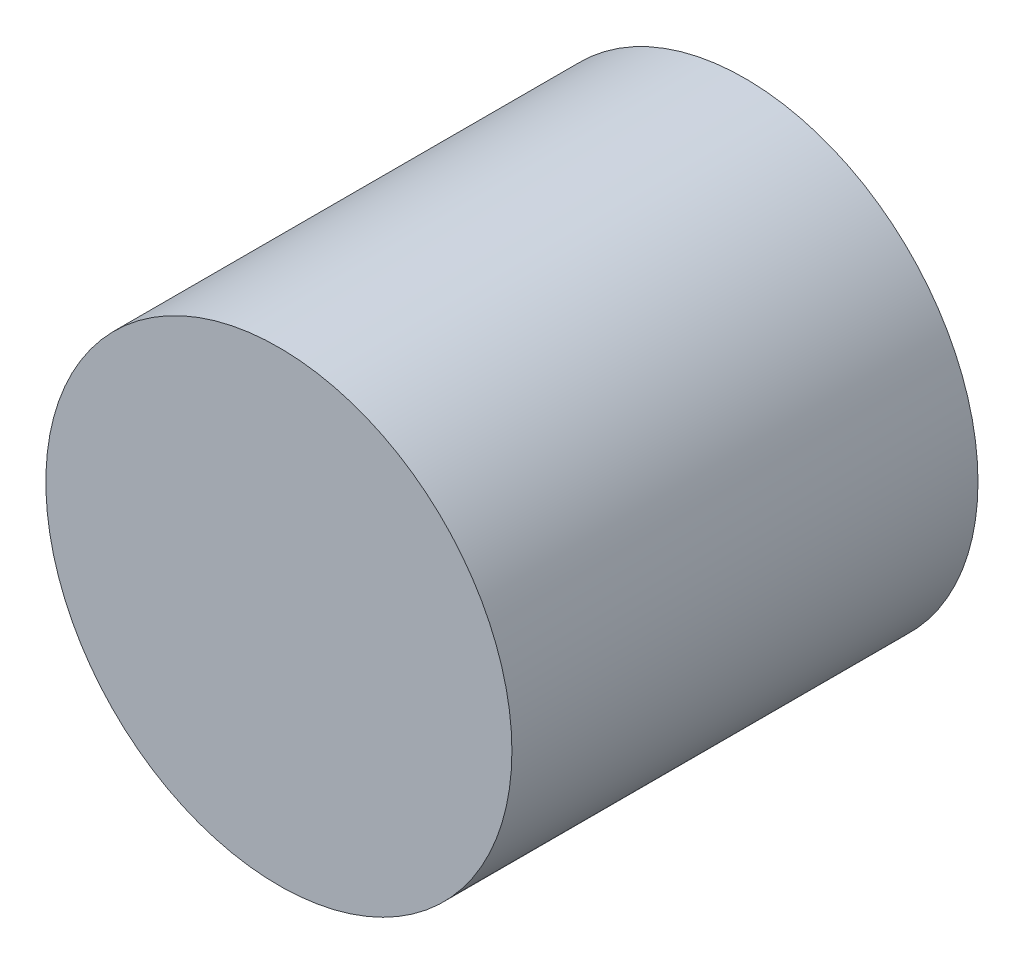
ISO-10303-21;
HEADER;
FILE_DESCRIPTION(('STEP AP214'),'2;1');
FILE_NAME('part.step','',(''),(''),'','','');
FILE_SCHEMA(('AUTOMOTIVE_DESIGN { 1 0 10303 214 1 1 1 1 }'));
ENDSEC;
DATA;
#1=APPLICATION_CONTEXT('core data for automotive mechanical design processes');
#2=APPLICATION_PROTOCOL_DEFINITION('international standard','automotive_design',2000,#1);
#3=PRODUCT_CONTEXT('',#1,'mechanical');
#4=PRODUCT('Part','Part','',(#3));
#5=PRODUCT_RELATED_PRODUCT_CATEGORY('part','',(#4));
#6=PRODUCT_DEFINITION_FORMATION('','',#4);
#7=PRODUCT_DEFINITION_CONTEXT('part definition',#1,'design');
#8=PRODUCT_DEFINITION('design','',#6,#7);
#9=PRODUCT_DEFINITION_SHAPE('','',#8);
#10=(LENGTH_UNIT() NAMED_UNIT(*) SI_UNIT(.MILLI.,.METRE.));
#11=(NAMED_UNIT(*) PLANE_ANGLE_UNIT() SI_UNIT($,.RADIAN.));
#12=(NAMED_UNIT(*) SI_UNIT($,.STERADIAN.) SOLID_ANGLE_UNIT());
#13=UNCERTAINTY_MEASURE_WITH_UNIT(LENGTH_MEASURE(1.E-05),#10,'distance_accuracy_value','');
#14=(GEOMETRIC_REPRESENTATION_CONTEXT(3) GLOBAL_UNCERTAINTY_ASSIGNED_CONTEXT((#13)) GLOBAL_UNIT_ASSIGNED_CONTEXT((#10,
#11,#12)) REPRESENTATION_CONTEXT('',''));
#15=CARTESIAN_POINT('',(0.,0.,0.));
#16=DIRECTION('',(0.,0.,1.));
#17=DIRECTION('',(1.,0.,0.));
#18=AXIS2_PLACEMENT_3D('',#15,#16,#17);
#19=CARTESIAN_POINT('',(0.,0.,0.5));
#20=DIRECTION('',(0.,0.,-1.));
#21=DIRECTION('',(-1.,0.,0.));
#22=AXIS2_PLACEMENT_3D('',#19,#20,#21);
#23=CYLINDRICAL_SURFACE('',#22,0.5);
#24=CARTESIAN_POINT('',(0.,0.,0.5));
#25=DIRECTION('',(0.,0.,1.));
#26=DIRECTION('',(1.,0.,0.));
#27=AXIS2_PLACEMENT_3D('',#24,#25,#26);
#28=CIRCLE('',#27,0.5);
#29=CARTESIAN_POINT('',(0.5,0.,0.5));
#30=VERTEX_POINT('',#29);
#31=EDGE_CURVE('E10',#30,#30,#28,.T.);
#32=ORIENTED_EDGE('',*,*,#31,.F.);
#33=EDGE_LOOP('',(#32));
#34=FACE_BOUND('',#33,.T.);
#35=CARTESIAN_POINT('',(0.,0.,-0.5));
#36=DIRECTION('',(0.,0.,1.));
#37=DIRECTION('',(1.,0.,0.));
#38=AXIS2_PLACEMENT_3D('',#35,#36,#37);
#39=CIRCLE('',#38,0.5);
#40=CARTESIAN_POINT('',(0.5,0.,-0.5));
#41=VERTEX_POINT('',#40);
#42=EDGE_CURVE('E34',#41,#41,#39,.T.);
#43=ORIENTED_EDGE('',*,*,#42,.T.);
#44=EDGE_LOOP('',(#43));
#45=FACE_BOUND('',#44,.T.);
#46=ADVANCED_FACE('F31',(#34,#45),#23,.T.);
#47=CARTESIAN_POINT('',(0.,0.,0.5));
#48=DIRECTION('',(0.,0.,1.));
#49=DIRECTION('',(1.,0.,0.));
#50=AXIS2_PLACEMENT_3D('',#47,#48,#49);
#51=PLANE('',#50);
#52=ORIENTED_EDGE('',*,*,#31,.T.);
#53=EDGE_LOOP('',(#52));
#54=FACE_BOUND('',#53,.T.);
#55=ADVANCED_FACE('F46',(#54),#51,.T.);
#56=CARTESIAN_POINT('',(0.,0.,-0.5));
#57=DIRECTION('',(0.,0.,1.));
#58=DIRECTION('',(1.,0.,0.));
#59=AXIS2_PLACEMENT_3D('',#56,#57,#58);
#60=PLANE('',#59);
#61=ORIENTED_EDGE('',*,*,#42,.F.);
#62=EDGE_LOOP('',(#61));
#63=FACE_BOUND('',#62,.T.);
#64=ADVANCED_FACE('F44',(#63),#60,.F.);
#65=CLOSED_SHELL('',(#46,#55,#64));
#66=MANIFOLD_SOLID_BREP('B2',#65);
#67=ADVANCED_BREP_SHAPE_REPRESENTATION('',(#18,#66),#14);
#68=SHAPE_DEFINITION_REPRESENTATION(#9,#67);
ENDSEC;
END-ISO-10303-21;
